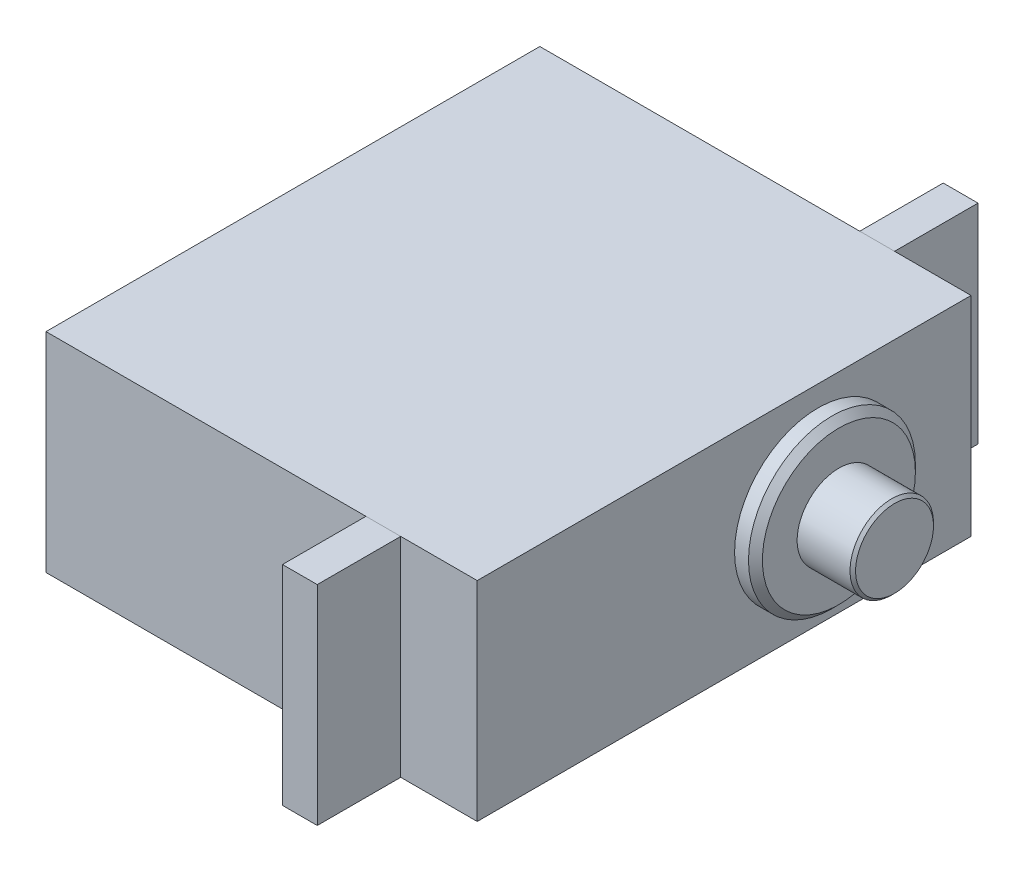
ISO-10303-21;
HEADER;
FILE_DESCRIPTION(('STEP AP214'),'2;1');
FILE_NAME('part.step','',(''),(''),'','','');
FILE_SCHEMA(('AUTOMOTIVE_DESIGN { 1 0 10303 214 1 1 1 1 }'));
ENDSEC;
DATA;
#1=APPLICATION_CONTEXT('core data for automotive mechanical design processes');
#2=APPLICATION_PROTOCOL_DEFINITION('international standard','automotive_design',2000,#1);
#3=PRODUCT_CONTEXT('',#1,'mechanical');
#4=PRODUCT('Part','Part','',(#3));
#5=PRODUCT_RELATED_PRODUCT_CATEGORY('part','',(#4));
#6=PRODUCT_DEFINITION_FORMATION('','',#4);
#7=PRODUCT_DEFINITION_CONTEXT('part definition',#1,'design');
#8=PRODUCT_DEFINITION('design','',#6,#7);
#9=PRODUCT_DEFINITION_SHAPE('','',#8);
#10=(LENGTH_UNIT() NAMED_UNIT(*) SI_UNIT(.MILLI.,.METRE.));
#11=(NAMED_UNIT(*) PLANE_ANGLE_UNIT() SI_UNIT($,.RADIAN.));
#12=(NAMED_UNIT(*) SI_UNIT($,.STERADIAN.) SOLID_ANGLE_UNIT());
#13=UNCERTAINTY_MEASURE_WITH_UNIT(LENGTH_MEASURE(1.E-05),#10,'distance_accuracy_value','');
#14=(GEOMETRIC_REPRESENTATION_CONTEXT(3) GLOBAL_UNCERTAINTY_ASSIGNED_CONTEXT((#13)) GLOBAL_UNIT_ASSIGNED_CONTEXT((#10,
#11,#12)) REPRESENTATION_CONTEXT('',''));
#15=CARTESIAN_POINT('',(0.,0.,0.));
#16=DIRECTION('',(0.,0.,1.));
#17=DIRECTION('',(1.,0.,0.));
#18=AXIS2_PLACEMENT_3D('',#15,#16,#17);
#19=CARTESIAN_POINT('',(25.5,-7.5,17.75));
#20=DIRECTION('',(1.,0.,0.));
#21=DIRECTION('',(0.,0.,-1.));
#22=AXIS2_PLACEMENT_3D('',#19,#20,#21);
#23=PLANE('',#22);
#24=DIRECTION('',(0.,0.,-1.));
#25=VECTOR('',#24,1.);
#26=CARTESIAN_POINT('',(25.5,7.5,17.75));
#27=LINE('',#26,#25);
#28=CARTESIAN_POINT('',(25.5,7.5,23.75));
#29=VERTEX_POINT('',#28);
#30=CARTESIAN_POINT('',(25.5,7.5,17.75));
#31=VERTEX_POINT('',#30);
#32=EDGE_CURVE('E109',#29,#31,#27,.T.);
#33=ORIENTED_EDGE('',*,*,#32,.F.);
#34=DIRECTION('',(0.,1.,0.));
#35=VECTOR('',#34,1.);
#36=CARTESIAN_POINT('',(25.5,-7.5,23.75));
#37=LINE('',#36,#35);
#38=CARTESIAN_POINT('',(25.5,-7.5,23.75));
#39=VERTEX_POINT('',#38);
#40=EDGE_CURVE('E12',#39,#29,#37,.T.);
#41=ORIENTED_EDGE('',*,*,#40,.F.);
#42=DIRECTION('',(0.,0.,-1.));
#43=VECTOR('',#42,1.);
#44=CARTESIAN_POINT('',(25.5,-7.5,17.75));
#45=LINE('',#44,#43);
#46=CARTESIAN_POINT('',(25.5,-7.5,17.75));
#47=VERTEX_POINT('',#46);
#48=EDGE_CURVE('E103',#39,#47,#45,.T.);
#49=ORIENTED_EDGE('',*,*,#48,.T.);
#50=DIRECTION('',(0.,1.,0.));
#51=VECTOR('',#50,1.);
#52=CARTESIAN_POINT('',(25.5,-7.5,17.75));
#53=LINE('',#52,#51);
#54=EDGE_CURVE('E48',#47,#31,#53,.T.);
#55=ORIENTED_EDGE('',*,*,#54,.T.);
#56=EDGE_LOOP('',(#33,#41,#49,#55));
#57=FACE_BOUND('',#56,.T.);
#58=ADVANCED_FACE('F45',(#57),#23,.T.);
#59=CARTESIAN_POINT('',(25.5,-7.5,23.75));
#60=DIRECTION('',(0.,0.,1.));
#61=DIRECTION('',(1.,0.,0.));
#62=AXIS2_PLACEMENT_3D('',#59,#60,#61);
#63=PLANE('',#62);
#64=DIRECTION('',(1.,0.,0.));
#65=VECTOR('',#64,1.);
#66=CARTESIAN_POINT('',(25.5,7.5,23.75));
#67=LINE('',#66,#65);
#68=CARTESIAN_POINT('',(23.,7.5,23.75));
#69=VERTEX_POINT('',#68);
#70=EDGE_CURVE('E105',#69,#29,#67,.T.);
#71=ORIENTED_EDGE('',*,*,#70,.F.);
#72=DIRECTION('',(0.,1.,0.));
#73=VECTOR('',#72,1.);
#74=CARTESIAN_POINT('',(23.,-7.5,23.75));
#75=LINE('',#74,#73);
#76=CARTESIAN_POINT('',(23.,-7.5,23.75));
#77=VERTEX_POINT('',#76);
#78=EDGE_CURVE('E54',#77,#69,#75,.T.);
#79=ORIENTED_EDGE('',*,*,#78,.F.);
#80=DIRECTION('',(1.,0.,0.));
#81=VECTOR('',#80,1.);
#82=CARTESIAN_POINT('',(25.5,-7.5,23.75));
#83=LINE('',#82,#81);
#84=EDGE_CURVE('E100',#77,#39,#83,.T.);
#85=ORIENTED_EDGE('',*,*,#84,.T.);
#86=ORIENTED_EDGE('',*,*,#40,.T.);
#87=EDGE_LOOP('',(#71,#79,#85,#86));
#88=FACE_BOUND('',#87,.T.);
#89=ADVANCED_FACE('F119',(#88),#63,.T.);
#90=CARTESIAN_POINT('',(23.,-7.5,17.75));
#91=DIRECTION('',(-1.,0.,0.));
#92=DIRECTION('',(0.,0.,1.));
#93=AXIS2_PLACEMENT_3D('',#90,#91,#92);
#94=PLANE('',#93);
#95=DIRECTION('',(0.,0.,1.));
#96=VECTOR('',#95,1.);
#97=CARTESIAN_POINT('',(23.,7.5,17.75));
#98=LINE('',#97,#96);
#99=CARTESIAN_POINT('',(23.,7.5,17.75));
#100=VERTEX_POINT('',#99);
#101=EDGE_CURVE('E95',#100,#69,#98,.T.);
#102=ORIENTED_EDGE('',*,*,#101,.F.);
#103=DIRECTION('',(0.,1.,0.));
#104=VECTOR('',#103,1.);
#105=CARTESIAN_POINT('',(23.,-7.5,17.75));
#106=LINE('',#105,#104);
#107=CARTESIAN_POINT('',(23.,-7.5,17.75));
#108=VERTEX_POINT('',#107);
#109=EDGE_CURVE('E90',#108,#100,#106,.T.);
#110=ORIENTED_EDGE('',*,*,#109,.F.);
#111=DIRECTION('',(0.,0.,1.));
#112=VECTOR('',#111,1.);
#113=CARTESIAN_POINT('',(23.,-7.5,17.75));
#114=LINE('',#113,#112);
#115=EDGE_CURVE('E93',#108,#77,#114,.T.);
#116=ORIENTED_EDGE('',*,*,#115,.T.);
#117=ORIENTED_EDGE('',*,*,#78,.T.);
#118=EDGE_LOOP('',(#102,#110,#116,#117));
#119=FACE_BOUND('',#118,.T.);
#120=ADVANCED_FACE('F92',(#119),#94,.T.);
#121=CARTESIAN_POINT('',(25.5,-7.5,17.75));
#122=DIRECTION('',(0.,0.,-1.));
#123=DIRECTION('',(-1.,0.,0.));
#124=AXIS2_PLACEMENT_3D('',#121,#122,#123);
#125=PLANE('',#124);
#126=DIRECTION('',(-1.,0.,0.));
#127=VECTOR('',#126,1.);
#128=CARTESIAN_POINT('',(25.5,7.5,17.75));
#129=LINE('',#128,#127);
#130=EDGE_CURVE('E112',#31,#100,#129,.T.);
#131=ORIENTED_EDGE('',*,*,#130,.F.);
#132=ORIENTED_EDGE('',*,*,#54,.F.);
#133=DIRECTION('',(-1.,0.,0.));
#134=VECTOR('',#133,1.);
#135=CARTESIAN_POINT('',(25.5,-7.5,17.75));
#136=LINE('',#135,#134);
#137=EDGE_CURVE('E99',#47,#108,#136,.T.);
#138=ORIENTED_EDGE('',*,*,#137,.T.);
#139=ORIENTED_EDGE('',*,*,#109,.T.);
#140=EDGE_LOOP('',(#131,#132,#138,#139));
#141=FACE_BOUND('',#140,.T.);
#142=ADVANCED_FACE('F102',(#141),#125,.T.);
#143=CARTESIAN_POINT('',(0.,-7.5,0.));
#144=DIRECTION('',(0.,-1.,0.));
#145=DIRECTION('',(0.,0.,-1.));
#146=AXIS2_PLACEMENT_3D('',#143,#144,#145);
#147=PLANE('',#146);
#148=ORIENTED_EDGE('',*,*,#48,.F.);
#149=ORIENTED_EDGE('',*,*,#84,.F.);
#150=ORIENTED_EDGE('',*,*,#115,.F.);
#151=ORIENTED_EDGE('',*,*,#137,.F.);
#152=EDGE_LOOP('',(#148,#149,#150,#151));
#153=FACE_BOUND('',#152,.T.);
#154=ADVANCED_FACE('F98',(#153),#147,.T.);
#155=CARTESIAN_POINT('',(0.,7.5,0.));
#156=DIRECTION('',(0.,-1.,0.));
#157=DIRECTION('',(0.,0.,-1.));
#158=AXIS2_PLACEMENT_3D('',#155,#156,#157);
#159=PLANE('',#158);
#160=ORIENTED_EDGE('',*,*,#32,.T.);
#161=ORIENTED_EDGE('',*,*,#130,.T.);
#162=ORIENTED_EDGE('',*,*,#101,.T.);
#163=ORIENTED_EDGE('',*,*,#70,.T.);
#164=EDGE_LOOP('',(#160,#161,#162,#163));
#165=FACE_BOUND('',#164,.T.);
#166=ADVANCED_FACE('F118',(#165),#159,.F.);
#167=CLOSED_SHELL('',(#58,#89,#120,#142,#154,#166));
#168=MANIFOLD_SOLID_BREP('B2',#167);
#169=CARTESIAN_POINT('',(25.5,-7.5,-17.75));
#170=DIRECTION('',(1.,0.,0.));
#171=DIRECTION('',(0.,0.,-1.));
#172=AXIS2_PLACEMENT_3D('',#169,#170,#171);
#173=PLANE('',#172);
#174=DIRECTION('',(0.,0.,-1.));
#175=VECTOR('',#174,1.);
#176=CARTESIAN_POINT('',(25.5,7.5,-17.75));
#177=LINE('',#176,#175);
#178=CARTESIAN_POINT('',(25.5,7.5,-17.75));
#179=VERTEX_POINT('',#178);
#180=CARTESIAN_POINT('',(25.5,7.5,-23.75));
#181=VERTEX_POINT('',#180);
#182=EDGE_CURVE('E241',#179,#181,#177,.T.);
#183=ORIENTED_EDGE('',*,*,#182,.F.);
#184=DIRECTION('',(0.,1.,0.));
#185=VECTOR('',#184,1.);
#186=CARTESIAN_POINT('',(25.5,-7.5,-17.75));
#187=LINE('',#186,#185);
#188=CARTESIAN_POINT('',(25.5,-7.5,-17.75));
#189=VERTEX_POINT('',#188);
#190=EDGE_CURVE('E43',#189,#179,#187,.T.);
#191=ORIENTED_EDGE('',*,*,#190,.F.);
#192=DIRECTION('',(0.,0.,-1.));
#193=VECTOR('',#192,1.);
#194=CARTESIAN_POINT('',(25.5,-7.5,-17.75));
#195=LINE('',#194,#193);
#196=CARTESIAN_POINT('',(25.5,-7.5,-23.75));
#197=VERTEX_POINT('',#196);
#198=EDGE_CURVE('E235',#189,#197,#195,.T.);
#199=ORIENTED_EDGE('',*,*,#198,.T.);
#200=DIRECTION('',(0.,1.,0.));
#201=VECTOR('',#200,1.);
#202=CARTESIAN_POINT('',(25.5,-7.5,-23.75));
#203=LINE('',#202,#201);
#204=EDGE_CURVE('E180',#197,#181,#203,.T.);
#205=ORIENTED_EDGE('',*,*,#204,.T.);
#206=EDGE_LOOP('',(#183,#191,#199,#205));
#207=FACE_BOUND('',#206,.T.);
#208=ADVANCED_FACE('F177',(#207),#173,.T.);
#209=CARTESIAN_POINT('',(25.5,-7.5,-17.75));
#210=DIRECTION('',(0.,0.,1.));
#211=DIRECTION('',(1.,0.,0.));
#212=AXIS2_PLACEMENT_3D('',#209,#210,#211);
#213=PLANE('',#212);
#214=DIRECTION('',(1.,0.,0.));
#215=VECTOR('',#214,1.);
#216=CARTESIAN_POINT('',(25.5,7.5,-17.75));
#217=LINE('',#216,#215);
#218=CARTESIAN_POINT('',(23.,7.5,-17.75));
#219=VERTEX_POINT('',#218);
#220=EDGE_CURVE('E237',#219,#179,#217,.T.);
#221=ORIENTED_EDGE('',*,*,#220,.F.);
#222=DIRECTION('',(0.,1.,0.));
#223=VECTOR('',#222,1.);
#224=CARTESIAN_POINT('',(23.,-7.5,-17.75));
#225=LINE('',#224,#223);
#226=CARTESIAN_POINT('',(23.,-7.5,-17.75));
#227=VERTEX_POINT('',#226);
#228=EDGE_CURVE('E186',#227,#219,#225,.T.);
#229=ORIENTED_EDGE('',*,*,#228,.F.);
#230=DIRECTION('',(1.,0.,0.));
#231=VECTOR('',#230,1.);
#232=CARTESIAN_POINT('',(25.5,-7.5,-17.75));
#233=LINE('',#232,#231);
#234=EDGE_CURVE('E232',#227,#189,#233,.T.);
#235=ORIENTED_EDGE('',*,*,#234,.T.);
#236=ORIENTED_EDGE('',*,*,#190,.T.);
#237=EDGE_LOOP('',(#221,#229,#235,#236));
#238=FACE_BOUND('',#237,.T.);
#239=ADVANCED_FACE('F251',(#238),#213,.T.);
#240=CARTESIAN_POINT('',(23.,-7.5,-17.75));
#241=DIRECTION('',(-1.,0.,0.));
#242=DIRECTION('',(0.,0.,1.));
#243=AXIS2_PLACEMENT_3D('',#240,#241,#242);
#244=PLANE('',#243);
#245=DIRECTION('',(0.,0.,1.));
#246=VECTOR('',#245,1.);
#247=CARTESIAN_POINT('',(23.,7.5,-17.75));
#248=LINE('',#247,#246);
#249=CARTESIAN_POINT('',(23.,7.5,-23.75));
#250=VERTEX_POINT('',#249);
#251=EDGE_CURVE('E227',#250,#219,#248,.T.);
#252=ORIENTED_EDGE('',*,*,#251,.F.);
#253=DIRECTION('',(0.,1.,0.));
#254=VECTOR('',#253,1.);
#255=CARTESIAN_POINT('',(23.,-7.5,-23.75));
#256=LINE('',#255,#254);
#257=CARTESIAN_POINT('',(23.,-7.5,-23.75));
#258=VERTEX_POINT('',#257);
#259=EDGE_CURVE('E222',#258,#250,#256,.T.);
#260=ORIENTED_EDGE('',*,*,#259,.F.);
#261=DIRECTION('',(0.,0.,1.));
#262=VECTOR('',#261,1.);
#263=CARTESIAN_POINT('',(23.,-7.5,-17.75));
#264=LINE('',#263,#262);
#265=EDGE_CURVE('E225',#258,#227,#264,.T.);
#266=ORIENTED_EDGE('',*,*,#265,.T.);
#267=ORIENTED_EDGE('',*,*,#228,.T.);
#268=EDGE_LOOP('',(#252,#260,#266,#267));
#269=FACE_BOUND('',#268,.T.);
#270=ADVANCED_FACE('F224',(#269),#244,.T.);
#271=CARTESIAN_POINT('',(25.5,-7.5,-23.75));
#272=DIRECTION('',(0.,0.,-1.));
#273=DIRECTION('',(-1.,0.,0.));
#274=AXIS2_PLACEMENT_3D('',#271,#272,#273);
#275=PLANE('',#274);
#276=DIRECTION('',(-1.,0.,0.));
#277=VECTOR('',#276,1.);
#278=CARTESIAN_POINT('',(25.5,7.5,-23.75));
#279=LINE('',#278,#277);
#280=EDGE_CURVE('E244',#181,#250,#279,.T.);
#281=ORIENTED_EDGE('',*,*,#280,.F.);
#282=ORIENTED_EDGE('',*,*,#204,.F.);
#283=DIRECTION('',(-1.,0.,0.));
#284=VECTOR('',#283,1.);
#285=CARTESIAN_POINT('',(25.5,-7.5,-23.75));
#286=LINE('',#285,#284);
#287=EDGE_CURVE('E231',#197,#258,#286,.T.);
#288=ORIENTED_EDGE('',*,*,#287,.T.);
#289=ORIENTED_EDGE('',*,*,#259,.T.);
#290=EDGE_LOOP('',(#281,#282,#288,#289));
#291=FACE_BOUND('',#290,.T.);
#292=ADVANCED_FACE('F234',(#291),#275,.T.);
#293=CARTESIAN_POINT('',(0.,-7.5,0.));
#294=DIRECTION('',(0.,1.,0.));
#295=DIRECTION('',(0.,0.,1.));
#296=AXIS2_PLACEMENT_3D('',#293,#294,#295);
#297=PLANE('',#296);
#298=ORIENTED_EDGE('',*,*,#198,.F.);
#299=ORIENTED_EDGE('',*,*,#234,.F.);
#300=ORIENTED_EDGE('',*,*,#265,.F.);
#301=ORIENTED_EDGE('',*,*,#287,.F.);
#302=EDGE_LOOP('',(#298,#299,#300,#301));
#303=FACE_BOUND('',#302,.T.);
#304=ADVANCED_FACE('F230',(#303),#297,.F.);
#305=CARTESIAN_POINT('',(0.,7.5,0.));
#306=DIRECTION('',(0.,1.,0.));
#307=DIRECTION('',(0.,0.,1.));
#308=AXIS2_PLACEMENT_3D('',#305,#306,#307);
#309=PLANE('',#308);
#310=ORIENTED_EDGE('',*,*,#182,.T.);
#311=ORIENTED_EDGE('',*,*,#280,.T.);
#312=ORIENTED_EDGE('',*,*,#251,.T.);
#313=ORIENTED_EDGE('',*,*,#220,.T.);
#314=EDGE_LOOP('',(#310,#311,#312,#313));
#315=FACE_BOUND('',#314,.T.);
#316=ADVANCED_FACE('F250',(#315),#309,.T.);
#317=CLOSED_SHELL('',(#208,#239,#270,#292,#304,#316));
#318=MANIFOLD_SOLID_BREP('B6',#317);
#319=CARTESIAN_POINT('',(31.,-7.5,-17.75));
#320=DIRECTION('',(0.,0.,1.));
#321=DIRECTION('',(1.,0.,0.));
#322=AXIS2_PLACEMENT_3D('',#319,#320,#321);
#323=PLANE('',#322);
#324=DIRECTION('',(0.,1.,0.));
#325=VECTOR('',#324,1.);
#326=CARTESIAN_POINT('',(0.,-7.5,-17.75));
#327=LINE('',#326,#325);
#328=CARTESIAN_POINT('',(0.,-7.5,-17.75));
#329=VERTEX_POINT('',#328);
#330=CARTESIAN_POINT('',(0.,7.5,-17.75));
#331=VERTEX_POINT('',#330);
#332=EDGE_CURVE('E369',#329,#331,#327,.T.);
#333=ORIENTED_EDGE('',*,*,#332,.T.);
#334=DIRECTION('',(-1.,0.,0.));
#335=VECTOR('',#334,1.);
#336=CARTESIAN_POINT('',(31.,7.5,-17.75));
#337=LINE('',#336,#335);
#338=CARTESIAN_POINT('',(31.,7.5,-17.75));
#339=VERTEX_POINT('',#338);
#340=EDGE_CURVE('E360',#339,#331,#337,.T.);
#341=ORIENTED_EDGE('',*,*,#340,.F.);
#342=DIRECTION('',(0.,1.,0.));
#343=VECTOR('',#342,1.);
#344=CARTESIAN_POINT('',(31.,-7.5,-17.75));
#345=LINE('',#344,#343);
#346=CARTESIAN_POINT('',(31.,-7.5,-17.75));
#347=VERTEX_POINT('',#346);
#348=EDGE_CURVE('E354',#347,#339,#345,.T.);
#349=ORIENTED_EDGE('',*,*,#348,.F.);
#350=DIRECTION('',(-1.,0.,0.));
#351=VECTOR('',#350,1.);
#352=CARTESIAN_POINT('',(31.,-7.5,-17.75));
#353=LINE('',#352,#351);
#354=EDGE_CURVE('E365',#347,#329,#353,.T.);
#355=ORIENTED_EDGE('',*,*,#354,.T.);
#356=EDGE_LOOP('',(#333,#341,#349,#355));
#357=FACE_BOUND('',#356,.T.);
#358=ADVANCED_FACE('F301',(#357),#323,.F.);
#359=CARTESIAN_POINT('',(31.,7.5,17.75));
#360=DIRECTION('',(0.,-1.,0.));
#361=DIRECTION('',(0.,0.,-1.));
#362=AXIS2_PLACEMENT_3D('',#359,#360,#361);
#363=PLANE('',#362);
#364=DIRECTION('',(0.,0.,1.));
#365=VECTOR('',#364,1.);
#366=CARTESIAN_POINT('',(0.,7.5,17.75));
#367=LINE('',#366,#365);
#368=CARTESIAN_POINT('',(0.,7.5,17.75));
#369=VERTEX_POINT('',#368);
#370=EDGE_CURVE('E359',#331,#369,#367,.T.);
#371=ORIENTED_EDGE('',*,*,#370,.T.);
#372=DIRECTION('',(-1.,0.,0.));
#373=VECTOR('',#372,1.);
#374=CARTESIAN_POINT('',(31.,7.5,17.75));
#375=LINE('',#374,#373);
#376=CARTESIAN_POINT('',(31.,7.5,17.75));
#377=VERTEX_POINT('',#376);
#378=EDGE_CURVE('E357',#377,#369,#375,.T.);
#379=ORIENTED_EDGE('',*,*,#378,.F.);
#380=DIRECTION('',(0.,0.,1.));
#381=VECTOR('',#380,1.);
#382=CARTESIAN_POINT('',(31.,7.5,17.75));
#383=LINE('',#382,#381);
#384=EDGE_CURVE('E349',#339,#377,#383,.T.);
#385=ORIENTED_EDGE('',*,*,#384,.F.);
#386=ORIENTED_EDGE('',*,*,#340,.T.);
#387=EDGE_LOOP('',(#371,#379,#385,#386));
#388=FACE_BOUND('',#387,.T.);
#389=ADVANCED_FACE('F358',(#388),#363,.F.);
#390=CARTESIAN_POINT('',(31.,-7.5,17.75));
#391=DIRECTION('',(0.,0.,-1.));
#392=DIRECTION('',(-1.,0.,0.));
#393=AXIS2_PLACEMENT_3D('',#390,#391,#392);
#394=PLANE('',#393);
#395=DIRECTION('',(0.,-1.,0.));
#396=VECTOR('',#395,1.);
#397=CARTESIAN_POINT('',(0.,-7.5,17.75));
#398=LINE('',#397,#396);
#399=CARTESIAN_POINT('',(0.,-7.5,17.75));
#400=VERTEX_POINT('',#399);
#401=EDGE_CURVE('E335',#369,#400,#398,.T.);
#402=ORIENTED_EDGE('',*,*,#401,.T.);
#403=DIRECTION('',(-1.,0.,0.));
#404=VECTOR('',#403,1.);
#405=CARTESIAN_POINT('',(31.,-7.5,17.75));
#406=LINE('',#405,#404);
#407=CARTESIAN_POINT('',(31.,-7.5,17.75));
#408=VERTEX_POINT('',#407);
#409=EDGE_CURVE('E361',#408,#400,#406,.T.);
#410=ORIENTED_EDGE('',*,*,#409,.F.);
#411=DIRECTION('',(0.,-1.,0.));
#412=VECTOR('',#411,1.);
#413=CARTESIAN_POINT('',(31.,-7.5,17.75));
#414=LINE('',#413,#412);
#415=EDGE_CURVE('E352',#377,#408,#414,.T.);
#416=ORIENTED_EDGE('',*,*,#415,.F.);
#417=ORIENTED_EDGE('',*,*,#378,.T.);
#418=EDGE_LOOP('',(#402,#410,#416,#417));
#419=FACE_BOUND('',#418,.T.);
#420=ADVANCED_FACE('F363',(#419),#394,.F.);
#421=CARTESIAN_POINT('',(31.,-7.5,17.75));
#422=DIRECTION('',(0.,1.,0.));
#423=DIRECTION('',(0.,0.,1.));
#424=AXIS2_PLACEMENT_3D('',#421,#422,#423);
#425=PLANE('',#424);
#426=DIRECTION('',(0.,0.,-1.));
#427=VECTOR('',#426,1.);
#428=CARTESIAN_POINT('',(0.,-7.5,17.75));
#429=LINE('',#428,#427);
#430=EDGE_CURVE('E341',#400,#329,#429,.T.);
#431=ORIENTED_EDGE('',*,*,#430,.T.);
#432=ORIENTED_EDGE('',*,*,#354,.F.);
#433=DIRECTION('',(0.,0.,-1.));
#434=VECTOR('',#433,1.);
#435=CARTESIAN_POINT('',(31.,-7.5,17.75));
#436=LINE('',#435,#434);
#437=EDGE_CURVE('E318',#408,#347,#436,.T.);
#438=ORIENTED_EDGE('',*,*,#437,.F.);
#439=ORIENTED_EDGE('',*,*,#409,.T.);
#440=EDGE_LOOP('',(#431,#432,#438,#439));
#441=FACE_BOUND('',#440,.T.);
#442=ADVANCED_FACE('F433',(#441),#425,.F.);
#443=CARTESIAN_POINT('',(31.,0.,0.));
#444=DIRECTION('',(-1.,0.,0.));
#445=DIRECTION('',(0.,0.,1.));
#446=AXIS2_PLACEMENT_3D('',#443,#444,#445);
#447=PLANE('',#446);
#448=CARTESIAN_POINT('',(31.,0.,-6.75));
#449=DIRECTION('',(-1.,0.,0.));
#450=DIRECTION('',(0.,0.,1.));
#451=AXIS2_PLACEMENT_3D('',#448,#449,#450);
#452=CIRCLE('',#451,6.);
#453=CARTESIAN_POINT('',(31.,0.,-0.749999999999996));
#454=VERTEX_POINT('',#453);
#455=EDGE_CURVE('E379',#454,#454,#452,.F.);
#456=ORIENTED_EDGE('',*,*,#455,.F.);
#457=EDGE_LOOP('',(#456));
#458=FACE_BOUND('',#457,.T.);
#459=ORIENTED_EDGE('',*,*,#348,.T.);
#460=ORIENTED_EDGE('',*,*,#384,.T.);
#461=ORIENTED_EDGE('',*,*,#415,.T.);
#462=ORIENTED_EDGE('',*,*,#437,.T.);
#463=EDGE_LOOP('',(#459,#460,#461,#462));
#464=FACE_BOUND('',#463,.T.);
#465=ADVANCED_FACE('F350',(#458,#464),#447,.F.);
#466=CARTESIAN_POINT('',(0.,0.,0.));
#467=DIRECTION('',(-1.,0.,0.));
#468=DIRECTION('',(0.,0.,1.));
#469=AXIS2_PLACEMENT_3D('',#466,#467,#468);
#470=PLANE('',#469);
#471=ORIENTED_EDGE('',*,*,#332,.F.);
#472=ORIENTED_EDGE('',*,*,#430,.F.);
#473=ORIENTED_EDGE('',*,*,#401,.F.);
#474=ORIENTED_EDGE('',*,*,#370,.F.);
#475=EDGE_LOOP('',(#471,#472,#473,#474));
#476=FACE_BOUND('',#475,.T.);
#477=ADVANCED_FACE('F428',(#476),#470,.T.);
#478=CARTESIAN_POINT('',(32.5,0.,-6.75));
#479=DIRECTION('',(-1.,0.,0.));
#480=DIRECTION('',(0.,0.,1.));
#481=AXIS2_PLACEMENT_3D('',#478,#479,#480);
#482=CYLINDRICAL_SURFACE('',#481,6.);
#483=CARTESIAN_POINT('',(32.,0.,-6.75));
#484=DIRECTION('',(1.,0.,0.));
#485=DIRECTION('',(0.,0.,-1.));
#486=AXIS2_PLACEMENT_3D('',#483,#484,#485);
#487=CIRCLE('',#486,6.);
#488=CARTESIAN_POINT('',(32.,0.,-12.75));
#489=VERTEX_POINT('',#488);
#490=EDGE_CURVE('E385',#489,#489,#487,.F.);
#491=ORIENTED_EDGE('',*,*,#490,.T.);
#492=EDGE_LOOP('',(#491));
#493=FACE_BOUND('',#492,.T.);
#494=ORIENTED_EDGE('',*,*,#455,.T.);
#495=EDGE_LOOP('',(#494));
#496=FACE_BOUND('',#495,.T.);
#497=ADVANCED_FACE('F418',(#493,#496),#482,.T.);
#498=CARTESIAN_POINT('',(32.5,0.,-6.75));
#499=DIRECTION('',(1.,0.,0.));
#500=DIRECTION('',(0.,0.,-1.));
#501=AXIS2_PLACEMENT_3D('',#498,#499,#500);
#502=PLANE('',#501);
#503=CARTESIAN_POINT('',(32.5,0.,-6.75));
#504=DIRECTION('',(1.,0.,0.));
#505=DIRECTION('',(0.,0.,-1.));
#506=AXIS2_PLACEMENT_3D('',#503,#504,#505);
#507=CIRCLE('',#506,3.);
#508=CARTESIAN_POINT('',(32.5,0.,-9.75));
#509=VERTEX_POINT('',#508);
#510=EDGE_CURVE('E372',#509,#509,#507,.T.);
#511=ORIENTED_EDGE('',*,*,#510,.F.);
#512=EDGE_LOOP('',(#511));
#513=FACE_BOUND('',#512,.T.);
#514=CARTESIAN_POINT('',(32.5,0.,-6.75));
#515=DIRECTION('',(1.,0.,0.));
#516=DIRECTION('',(0.,0.,-1.));
#517=AXIS2_PLACEMENT_3D('',#514,#515,#516);
#518=CIRCLE('',#517,5.49999999999999);
#519=CARTESIAN_POINT('',(32.5,0.,-12.25));
#520=VERTEX_POINT('',#519);
#521=EDGE_CURVE('E382',#520,#520,#518,.T.);
#522=ORIENTED_EDGE('',*,*,#521,.T.);
#523=EDGE_LOOP('',(#522));
#524=FACE_BOUND('',#523,.T.);
#525=ADVANCED_FACE('F410',(#513,#524),#502,.T.);
#526=CARTESIAN_POINT('',(32.5,0.,-6.75));
#527=DIRECTION('',(-1.,0.,0.));
#528=DIRECTION('',(0.,0.,1.));
#529=AXIS2_PLACEMENT_3D('',#526,#527,#528);
#530=CONICAL_SURFACE('',#529,5.49999999999999,0.785398163397446);
#531=ORIENTED_EDGE('',*,*,#490,.F.);
#532=EDGE_LOOP('',(#531));
#533=FACE_BOUND('',#532,.T.);
#534=ORIENTED_EDGE('',*,*,#521,.F.);
#535=EDGE_LOOP('',(#534));
#536=FACE_BOUND('',#535,.T.);
#537=ADVANCED_FACE('F408',(#533,#536),#530,.T.);
#538=CARTESIAN_POINT('',(36.5,0.,-6.75));
#539=DIRECTION('',(-1.,0.,0.));
#540=DIRECTION('',(0.,0.,1.));
#541=AXIS2_PLACEMENT_3D('',#538,#539,#540);
#542=CYLINDRICAL_SURFACE('',#541,3.);
#543=CARTESIAN_POINT('',(36.3,0.,-6.75));
#544=DIRECTION('',(1.,0.,0.));
#545=DIRECTION('',(0.,0.,-1.));
#546=AXIS2_PLACEMENT_3D('',#543,#544,#545);
#547=CIRCLE('',#546,3.);
#548=CARTESIAN_POINT('',(36.3,0.,-9.75));
#549=VERTEX_POINT('',#548);
#550=EDGE_CURVE('E175',#549,#549,#547,.F.);
#551=ORIENTED_EDGE('',*,*,#550,.T.);
#552=EDGE_LOOP('',(#551));
#553=FACE_BOUND('',#552,.T.);
#554=ORIENTED_EDGE('',*,*,#510,.T.);
#555=EDGE_LOOP('',(#554));
#556=FACE_BOUND('',#555,.T.);
#557=ADVANCED_FACE('F397',(#553,#556),#542,.T.);
#558=CARTESIAN_POINT('',(36.5,0.,-6.75));
#559=DIRECTION('',(1.,0.,0.));
#560=DIRECTION('',(0.,0.,-1.));
#561=AXIS2_PLACEMENT_3D('',#558,#559,#560);
#562=PLANE('',#561);
#563=CARTESIAN_POINT('',(36.5,0.,-6.75));
#564=DIRECTION('',(1.,0.,0.));
#565=DIRECTION('',(0.,0.,-1.));
#566=AXIS2_PLACEMENT_3D('',#563,#564,#565);
#567=CIRCLE('',#566,2.8);
#568=CARTESIAN_POINT('',(36.5,0.,-9.55));
#569=VERTEX_POINT('',#568);
#570=EDGE_CURVE('E310',#569,#569,#567,.T.);
#571=ORIENTED_EDGE('',*,*,#570,.T.);
#572=EDGE_LOOP('',(#571));
#573=FACE_BOUND('',#572,.T.);
#574=ADVANCED_FACE('F390',(#573),#562,.T.);
#575=CARTESIAN_POINT('',(36.5,0.,-6.75));
#576=DIRECTION('',(-1.,0.,0.));
#577=DIRECTION('',(0.,0.,1.));
#578=AXIS2_PLACEMENT_3D('',#575,#576,#577);
#579=CONICAL_SURFACE('',#578,2.8,0.785398163397457);
#580=ORIENTED_EDGE('',*,*,#550,.F.);
#581=EDGE_LOOP('',(#580));
#582=FACE_BOUND('',#581,.T.);
#583=ORIENTED_EDGE('',*,*,#570,.F.);
#584=EDGE_LOOP('',(#583));
#585=FACE_BOUND('',#584,.T.);
#586=ADVANCED_FACE('F303',(#582,#585),#579,.T.);
#587=CLOSED_SHELL('',(#358,#389,#420,#442,#465,#477,#497,#525,#537,#557,#574,#586));
#588=MANIFOLD_SOLID_BREP('B37',#587);
#589=ADVANCED_BREP_SHAPE_REPRESENTATION('',(#18,#168,#318,#588),#14);
#590=SHAPE_DEFINITION_REPRESENTATION(#9,#589);
ENDSEC;
END-ISO-10303-21;
